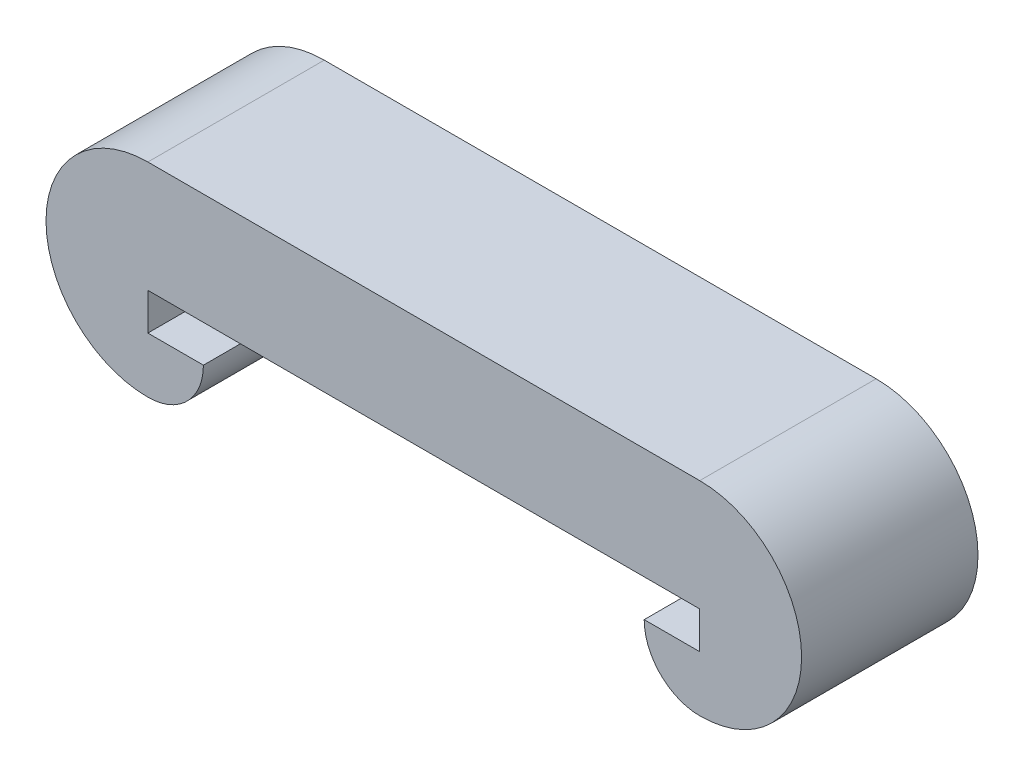
ISO-10303-21;
HEADER;
FILE_DESCRIPTION(('STEP AP214'),'2;1');
FILE_NAME('part.step','',(''),(''),'','','');
FILE_SCHEMA(('AUTOMOTIVE_DESIGN { 1 0 10303 214 1 1 1 1 }'));
ENDSEC;
DATA;
#1=APPLICATION_CONTEXT('core data for automotive mechanical design processes');
#2=APPLICATION_PROTOCOL_DEFINITION('international standard','automotive_design',2000,#1);
#3=PRODUCT_CONTEXT('',#1,'mechanical');
#4=PRODUCT('Part','Part','',(#3));
#5=PRODUCT_RELATED_PRODUCT_CATEGORY('part','',(#4));
#6=PRODUCT_DEFINITION_FORMATION('','',#4);
#7=PRODUCT_DEFINITION_CONTEXT('part definition',#1,'design');
#8=PRODUCT_DEFINITION('design','',#6,#7);
#9=PRODUCT_DEFINITION_SHAPE('','',#8);
#10=(LENGTH_UNIT() NAMED_UNIT(*) SI_UNIT(.MILLI.,.METRE.));
#11=(NAMED_UNIT(*) PLANE_ANGLE_UNIT() SI_UNIT($,.RADIAN.));
#12=(NAMED_UNIT(*) SI_UNIT($,.STERADIAN.) SOLID_ANGLE_UNIT());
#13=UNCERTAINTY_MEASURE_WITH_UNIT(LENGTH_MEASURE(1.E-05),#10,'distance_accuracy_value','');
#14=(GEOMETRIC_REPRESENTATION_CONTEXT(3) GLOBAL_UNCERTAINTY_ASSIGNED_CONTEXT((#13)) GLOBAL_UNIT_ASSIGNED_CONTEXT((#10,
#11,#12)) REPRESENTATION_CONTEXT('',''));
#15=CARTESIAN_POINT('',(0.,0.,0.));
#16=DIRECTION('',(0.,0.,1.));
#17=DIRECTION('',(1.,0.,0.));
#18=AXIS2_PLACEMENT_3D('',#15,#16,#17);
#19=CARTESIAN_POINT('',(-7.45,0.,4.7625));
#20=DIRECTION('',(-1.,0.,0.));
#21=DIRECTION('',(0.,0.,1.));
#22=AXIS2_PLACEMENT_3D('',#19,#20,#21);
#23=PLANE('',#22);
#24=DIRECTION('',(0.,1.,0.));
#25=VECTOR('',#24,1.);
#26=CARTESIAN_POINT('',(-7.45,0.,0.));
#27=LINE('',#26,#25);
#28=CARTESIAN_POINT('',(-7.45,-1.,0.));
#29=VERTEX_POINT('',#28);
#30=CARTESIAN_POINT('',(-7.45,0.,0.));
#31=VERTEX_POINT('',#30);
#32=EDGE_CURVE('E114',#29,#31,#27,.T.);
#33=ORIENTED_EDGE('',*,*,#32,.T.);
#34=DIRECTION('',(0.,0.,-1.));
#35=VECTOR('',#34,1.);
#36=CARTESIAN_POINT('',(-7.45,0.,4.7625));
#37=LINE('',#36,#35);
#38=CARTESIAN_POINT('',(-7.45,0.,4.7625));
#39=VERTEX_POINT('',#38);
#40=EDGE_CURVE('E11',#39,#31,#37,.T.);
#41=ORIENTED_EDGE('',*,*,#40,.F.);
#42=DIRECTION('',(0.,1.,0.));
#43=VECTOR('',#42,1.);
#44=CARTESIAN_POINT('',(-7.45,0.,4.7625));
#45=LINE('',#44,#43);
#46=CARTESIAN_POINT('',(-7.45,-1.,4.7625));
#47=VERTEX_POINT('',#46);
#48=EDGE_CURVE('E126',#47,#39,#45,.T.);
#49=ORIENTED_EDGE('',*,*,#48,.F.);
#50=DIRECTION('',(0.,0.,-1.));
#51=VECTOR('',#50,1.);
#52=CARTESIAN_POINT('',(-7.45,-1.,4.7625));
#53=LINE('',#52,#51);
#54=EDGE_CURVE('E110',#47,#29,#53,.T.);
#55=ORIENTED_EDGE('',*,*,#54,.T.);
#56=EDGE_LOOP('',(#33,#41,#49,#55));
#57=FACE_BOUND('',#56,.T.);
#58=ADVANCED_FACE('F31',(#57),#23,.F.);
#59=CARTESIAN_POINT('',(-7.45,0.,4.7625));
#60=DIRECTION('',(0.,1.,0.));
#61=DIRECTION('',(0.,0.,1.));
#62=AXIS2_PLACEMENT_3D('',#59,#60,#61);
#63=PLANE('',#62);
#64=DIRECTION('',(1.,0.,0.));
#65=VECTOR('',#64,1.);
#66=CARTESIAN_POINT('',(-7.45,0.,0.));
#67=LINE('',#66,#65);
#68=CARTESIAN_POINT('',(7.45,0.,0.));
#69=VERTEX_POINT('',#68);
#70=EDGE_CURVE('E117',#31,#69,#67,.T.);
#71=ORIENTED_EDGE('',*,*,#70,.T.);
#72=DIRECTION('',(0.,0.,-1.));
#73=VECTOR('',#72,1.);
#74=CARTESIAN_POINT('',(7.45,0.,4.7625));
#75=LINE('',#74,#73);
#76=CARTESIAN_POINT('',(7.45,0.,4.7625));
#77=VERTEX_POINT('',#76);
#78=EDGE_CURVE('E265',#77,#69,#75,.T.);
#79=ORIENTED_EDGE('',*,*,#78,.F.);
#80=DIRECTION('',(1.,0.,0.));
#81=VECTOR('',#80,1.);
#82=CARTESIAN_POINT('',(-7.45,0.,4.7625));
#83=LINE('',#82,#81);
#84=EDGE_CURVE('E82',#39,#77,#83,.T.);
#85=ORIENTED_EDGE('',*,*,#84,.F.);
#86=ORIENTED_EDGE('',*,*,#40,.T.);
#87=EDGE_LOOP('',(#71,#79,#85,#86));
#88=FACE_BOUND('',#87,.T.);
#89=ADVANCED_FACE('F151',(#88),#63,.F.);
#90=CARTESIAN_POINT('',(-7.45,3.,4.7625));
#91=DIRECTION('',(0.,-1.,0.));
#92=DIRECTION('',(0.,0.,-1.));
#93=AXIS2_PLACEMENT_3D('',#90,#91,#92);
#94=PLANE('',#93);
#95=DIRECTION('',(-1.,0.,0.));
#96=VECTOR('',#95,1.);
#97=CARTESIAN_POINT('',(-7.45,3.,0.));
#98=LINE('',#97,#96);
#99=CARTESIAN_POINT('',(7.45,3.00000000000001,0.));
#100=VERTEX_POINT('',#99);
#101=CARTESIAN_POINT('',(-7.45,3.,0.));
#102=VERTEX_POINT('',#101);
#103=EDGE_CURVE('E121',#100,#102,#98,.T.);
#104=ORIENTED_EDGE('',*,*,#103,.T.);
#105=DIRECTION('',(0.,0.,-1.));
#106=VECTOR('',#105,1.);
#107=CARTESIAN_POINT('',(-7.45,3.,4.7625));
#108=LINE('',#107,#106);
#109=CARTESIAN_POINT('',(-7.45,3.,4.7625));
#110=VERTEX_POINT('',#109);
#111=EDGE_CURVE('E39',#110,#102,#108,.T.);
#112=ORIENTED_EDGE('',*,*,#111,.F.);
#113=DIRECTION('',(-1.,0.,0.));
#114=VECTOR('',#113,1.);
#115=CARTESIAN_POINT('',(-7.45,3.,4.7625));
#116=LINE('',#115,#114);
#117=CARTESIAN_POINT('',(7.45,3.00000000000001,4.7625));
#118=VERTEX_POINT('',#117);
#119=EDGE_CURVE('E97',#118,#110,#116,.T.);
#120=ORIENTED_EDGE('',*,*,#119,.F.);
#121=DIRECTION('',(0.,0.,-1.));
#122=VECTOR('',#121,1.);
#123=CARTESIAN_POINT('',(7.45,3.00000000000001,4.7625));
#124=LINE('',#123,#122);
#125=EDGE_CURVE('E249',#118,#100,#124,.T.);
#126=ORIENTED_EDGE('',*,*,#125,.T.);
#127=EDGE_LOOP('',(#104,#112,#120,#126));
#128=FACE_BOUND('',#127,.T.);
#129=ADVANCED_FACE('F155',(#128),#94,.F.);
#130=CARTESIAN_POINT('',(-7.45,0.25,4.7625));
#131=DIRECTION('',(0.,0.,-1.));
#132=DIRECTION('',(-1.,0.,0.));
#133=AXIS2_PLACEMENT_3D('',#130,#131,#132);
#134=CYLINDRICAL_SURFACE('',#133,2.75);
#135=CARTESIAN_POINT('',(-7.45,0.25,0.));
#136=DIRECTION('',(0.,0.,1.));
#137=DIRECTION('',(-1.,0.,0.));
#138=AXIS2_PLACEMENT_3D('',#135,#136,#137);
#139=CIRCLE('',#138,2.75);
#140=CARTESIAN_POINT('',(-7.45,-2.5,0.));
#141=VERTEX_POINT('',#140);
#142=EDGE_CURVE('E105',#102,#141,#139,.T.);
#143=ORIENTED_EDGE('',*,*,#142,.T.);
#144=DIRECTION('',(0.,0.,-1.));
#145=VECTOR('',#144,1.);
#146=CARTESIAN_POINT('',(-7.45,-2.5,4.7625));
#147=LINE('',#146,#145);
#148=CARTESIAN_POINT('',(-7.45,-2.5,4.7625));
#149=VERTEX_POINT('',#148);
#150=EDGE_CURVE('E102',#149,#141,#147,.T.);
#151=ORIENTED_EDGE('',*,*,#150,.F.);
#152=CARTESIAN_POINT('',(-7.45,0.25,4.7625));
#153=DIRECTION('',(0.,0.,1.));
#154=DIRECTION('',(-1.,0.,0.));
#155=AXIS2_PLACEMENT_3D('',#152,#153,#154);
#156=CIRCLE('',#155,2.75);
#157=EDGE_CURVE('E90',#110,#149,#156,.T.);
#158=ORIENTED_EDGE('',*,*,#157,.F.);
#159=ORIENTED_EDGE('',*,*,#111,.T.);
#160=EDGE_LOOP('',(#143,#151,#158,#159));
#161=FACE_BOUND('',#160,.T.);
#162=ADVANCED_FACE('F103',(#161),#134,.T.);
#163=CARTESIAN_POINT('',(-7.45,-1.,4.7625));
#164=DIRECTION('',(0.,0.,-1.));
#165=DIRECTION('',(-1.,0.,0.));
#166=AXIS2_PLACEMENT_3D('',#163,#164,#165);
#167=CYLINDRICAL_SURFACE('',#166,1.5);
#168=CARTESIAN_POINT('',(-7.45,-1.,0.));
#169=DIRECTION('',(0.,0.,1.));
#170=DIRECTION('',(-1.,0.,0.));
#171=AXIS2_PLACEMENT_3D('',#168,#169,#170);
#172=CIRCLE('',#171,1.5);
#173=CARTESIAN_POINT('',(-5.95,-1.,0.));
#174=VERTEX_POINT('',#173);
#175=EDGE_CURVE('E68',#141,#174,#172,.T.);
#176=ORIENTED_EDGE('',*,*,#175,.T.);
#177=DIRECTION('',(0.,0.,-1.));
#178=VECTOR('',#177,1.);
#179=CARTESIAN_POINT('',(-5.95,-1.,4.7625));
#180=LINE('',#179,#178);
#181=CARTESIAN_POINT('',(-5.95,-1.,4.7625));
#182=VERTEX_POINT('',#181);
#183=EDGE_CURVE('E106',#182,#174,#180,.T.);
#184=ORIENTED_EDGE('',*,*,#183,.F.);
#185=CARTESIAN_POINT('',(-7.45,-1.,4.7625));
#186=DIRECTION('',(0.,0.,1.));
#187=DIRECTION('',(-1.,0.,0.));
#188=AXIS2_PLACEMENT_3D('',#185,#186,#187);
#189=CIRCLE('',#188,1.5);
#190=EDGE_CURVE('E94',#149,#182,#189,.T.);
#191=ORIENTED_EDGE('',*,*,#190,.F.);
#192=ORIENTED_EDGE('',*,*,#150,.T.);
#193=EDGE_LOOP('',(#176,#184,#191,#192));
#194=FACE_BOUND('',#193,.T.);
#195=ADVANCED_FACE('F108',(#194),#167,.T.);
#196=CARTESIAN_POINT('',(-7.45,-1.,4.7625));
#197=DIRECTION('',(0.,-1.,0.));
#198=DIRECTION('',(0.,0.,-1.));
#199=AXIS2_PLACEMENT_3D('',#196,#197,#198);
#200=PLANE('',#199);
#201=DIRECTION('',(-1.,0.,0.));
#202=VECTOR('',#201,1.);
#203=CARTESIAN_POINT('',(-7.45,-1.,0.));
#204=LINE('',#203,#202);
#205=EDGE_CURVE('E74',#174,#29,#204,.T.);
#206=ORIENTED_EDGE('',*,*,#205,.T.);
#207=ORIENTED_EDGE('',*,*,#54,.F.);
#208=DIRECTION('',(-1.,0.,0.));
#209=VECTOR('',#208,1.);
#210=CARTESIAN_POINT('',(-7.45,-1.,4.7625));
#211=LINE('',#210,#209);
#212=EDGE_CURVE('E47',#182,#47,#211,.T.);
#213=ORIENTED_EDGE('',*,*,#212,.F.);
#214=ORIENTED_EDGE('',*,*,#183,.T.);
#215=EDGE_LOOP('',(#206,#207,#213,#214));
#216=FACE_BOUND('',#215,.T.);
#217=ADVANCED_FACE('F140',(#216),#200,.F.);
#218=CARTESIAN_POINT('',(-7.45,-1.,4.7625));
#219=DIRECTION('',(0.,0.,-1.));
#220=DIRECTION('',(-1.,0.,0.));
#221=AXIS2_PLACEMENT_3D('',#218,#219,#220);
#222=PLANE('',#221);
#223=ORIENTED_EDGE('',*,*,#48,.T.);
#224=ORIENTED_EDGE('',*,*,#84,.T.);
#225=DIRECTION('',(0.,1.,0.));
#226=VECTOR('',#225,1.);
#227=CARTESIAN_POINT('',(7.45,0.,4.7625));
#228=LINE('',#227,#226);
#229=CARTESIAN_POINT('',(7.45,-0.999999999999996,4.7625));
#230=VERTEX_POINT('',#229);
#231=EDGE_CURVE('E255',#230,#77,#228,.T.);
#232=ORIENTED_EDGE('',*,*,#231,.F.);
#233=DIRECTION('',(1.,0.,0.));
#234=VECTOR('',#233,1.);
#235=CARTESIAN_POINT('',(7.45,-0.999999999999996,4.7625));
#236=LINE('',#235,#234);
#237=CARTESIAN_POINT('',(5.95,-0.999999999999996,4.7625));
#238=VERTEX_POINT('',#237);
#239=EDGE_CURVE('E259',#238,#230,#236,.T.);
#240=ORIENTED_EDGE('',*,*,#239,.F.);
#241=CARTESIAN_POINT('',(7.45,-0.999999999999996,4.7625));
#242=DIRECTION('',(0.,0.,-1.));
#243=DIRECTION('',(1.,0.,0.));
#244=AXIS2_PLACEMENT_3D('',#241,#242,#243);
#245=CIRCLE('',#244,1.5);
#246=CARTESIAN_POINT('',(7.45,-2.5,4.7625));
#247=VERTEX_POINT('',#246);
#248=EDGE_CURVE('E301',#247,#238,#245,.T.);
#249=ORIENTED_EDGE('',*,*,#248,.F.);
#250=CARTESIAN_POINT('',(7.45,0.250000000000004,4.7625));
#251=DIRECTION('',(0.,0.,-1.));
#252=DIRECTION('',(1.,0.,0.));
#253=AXIS2_PLACEMENT_3D('',#250,#251,#252);
#254=CIRCLE('',#253,2.75);
#255=EDGE_CURVE('E268',#118,#247,#254,.T.);
#256=ORIENTED_EDGE('',*,*,#255,.F.);
#257=ORIENTED_EDGE('',*,*,#119,.T.);
#258=ORIENTED_EDGE('',*,*,#157,.T.);
#259=ORIENTED_EDGE('',*,*,#190,.T.);
#260=ORIENTED_EDGE('',*,*,#212,.T.);
#261=EDGE_LOOP('',(#223,#224,#232,#240,#249,#256,#257,#258,#259,#260));
#262=FACE_BOUND('',#261,.T.);
#263=ADVANCED_FACE('F92',(#262),#222,.F.);
#264=CARTESIAN_POINT('',(-7.45,-1.,0.));
#265=DIRECTION('',(0.,0.,-1.));
#266=DIRECTION('',(-1.,0.,0.));
#267=AXIS2_PLACEMENT_3D('',#264,#265,#266);
#268=PLANE('',#267);
#269=ORIENTED_EDGE('',*,*,#32,.F.);
#270=ORIENTED_EDGE('',*,*,#205,.F.);
#271=ORIENTED_EDGE('',*,*,#175,.F.);
#272=ORIENTED_EDGE('',*,*,#142,.F.);
#273=ORIENTED_EDGE('',*,*,#103,.F.);
#274=CARTESIAN_POINT('',(7.45,0.250000000000004,0.));
#275=DIRECTION('',(0.,0.,-1.));
#276=DIRECTION('',(1.,0.,0.));
#277=AXIS2_PLACEMENT_3D('',#274,#275,#276);
#278=CIRCLE('',#277,2.75);
#279=CARTESIAN_POINT('',(7.45,-2.5,0.));
#280=VERTEX_POINT('',#279);
#281=EDGE_CURVE('E246',#100,#280,#278,.T.);
#282=ORIENTED_EDGE('',*,*,#281,.T.);
#283=CARTESIAN_POINT('',(7.45,-0.999999999999996,0.));
#284=DIRECTION('',(0.,0.,-1.));
#285=DIRECTION('',(1.,0.,0.));
#286=AXIS2_PLACEMENT_3D('',#283,#284,#285);
#287=CIRCLE('',#286,1.5);
#288=CARTESIAN_POINT('',(5.95,-0.999999999999996,0.));
#289=VERTEX_POINT('',#288);
#290=EDGE_CURVE('E256',#280,#289,#287,.T.);
#291=ORIENTED_EDGE('',*,*,#290,.T.);
#292=DIRECTION('',(1.,0.,0.));
#293=VECTOR('',#292,1.);
#294=CARTESIAN_POINT('',(7.45,-0.999999999999996,0.));
#295=LINE('',#294,#293);
#296=CARTESIAN_POINT('',(7.45,-0.999999999999996,0.));
#297=VERTEX_POINT('',#296);
#298=EDGE_CURVE('E261',#289,#297,#295,.T.);
#299=ORIENTED_EDGE('',*,*,#298,.T.);
#300=DIRECTION('',(0.,1.,0.));
#301=VECTOR('',#300,1.);
#302=CARTESIAN_POINT('',(7.45,0.,0.));
#303=LINE('',#302,#301);
#304=EDGE_CURVE('E285',#297,#69,#303,.T.);
#305=ORIENTED_EDGE('',*,*,#304,.T.);
#306=ORIENTED_EDGE('',*,*,#70,.F.);
#307=EDGE_LOOP('',(#269,#270,#271,#272,#273,#282,#291,#299,#305,#306));
#308=FACE_BOUND('',#307,.T.);
#309=ADVANCED_FACE('F132',(#308),#268,.T.);
#310=CARTESIAN_POINT('',(7.45,0.,4.7625));
#311=DIRECTION('',(-1.,0.,0.));
#312=DIRECTION('',(0.,-1.,0.));
#313=AXIS2_PLACEMENT_3D('',#310,#311,#312);
#314=PLANE('',#313);
#315=ORIENTED_EDGE('',*,*,#304,.F.);
#316=DIRECTION('',(0.,0.,-1.));
#317=VECTOR('',#316,1.);
#318=CARTESIAN_POINT('',(7.45,-0.999999999999996,4.7625));
#319=LINE('',#318,#317);
#320=EDGE_CURVE('E118',#230,#297,#319,.T.);
#321=ORIENTED_EDGE('',*,*,#320,.F.);
#322=ORIENTED_EDGE('',*,*,#231,.T.);
#323=ORIENTED_EDGE('',*,*,#78,.T.);
#324=EDGE_LOOP('',(#315,#321,#322,#323));
#325=FACE_BOUND('',#324,.T.);
#326=ADVANCED_FACE('F201',(#325),#314,.T.);
#327=CARTESIAN_POINT('',(7.45,-0.999999999999996,4.7625));
#328=DIRECTION('',(0.,1.,0.));
#329=DIRECTION('',(-1.,0.,0.));
#330=AXIS2_PLACEMENT_3D('',#327,#328,#329);
#331=PLANE('',#330);
#332=ORIENTED_EDGE('',*,*,#298,.F.);
#333=DIRECTION('',(0.,0.,-1.));
#334=VECTOR('',#333,1.);
#335=CARTESIAN_POINT('',(5.95,-0.999999999999996,4.7625));
#336=LINE('',#335,#334);
#337=EDGE_CURVE('E271',#238,#289,#336,.T.);
#338=ORIENTED_EDGE('',*,*,#337,.F.);
#339=ORIENTED_EDGE('',*,*,#239,.T.);
#340=ORIENTED_EDGE('',*,*,#320,.T.);
#341=EDGE_LOOP('',(#332,#338,#339,#340));
#342=FACE_BOUND('',#341,.T.);
#343=ADVANCED_FACE('F209',(#342),#331,.T.);
#344=CARTESIAN_POINT('',(7.45,-0.999999999999996,4.7625));
#345=DIRECTION('',(0.,0.,-1.));
#346=DIRECTION('',(-1.,0.,0.));
#347=AXIS2_PLACEMENT_3D('',#344,#345,#346);
#348=CYLINDRICAL_SURFACE('',#347,1.5);
#349=ORIENTED_EDGE('',*,*,#290,.F.);
#350=DIRECTION('',(0.,0.,-1.));
#351=VECTOR('',#350,1.);
#352=CARTESIAN_POINT('',(7.45,-2.5,4.7625));
#353=LINE('',#352,#351);
#354=EDGE_CURVE('E252',#247,#280,#353,.T.);
#355=ORIENTED_EDGE('',*,*,#354,.F.);
#356=ORIENTED_EDGE('',*,*,#248,.T.);
#357=ORIENTED_EDGE('',*,*,#337,.T.);
#358=EDGE_LOOP('',(#349,#355,#356,#357));
#359=FACE_BOUND('',#358,.T.);
#360=ADVANCED_FACE('F219',(#359),#348,.T.);
#361=CARTESIAN_POINT('',(7.45,0.250000000000004,4.7625));
#362=DIRECTION('',(0.,0.,-1.));
#363=DIRECTION('',(-1.,0.,0.));
#364=AXIS2_PLACEMENT_3D('',#361,#362,#363);
#365=CYLINDRICAL_SURFACE('',#364,2.75);
#366=ORIENTED_EDGE('',*,*,#281,.F.);
#367=ORIENTED_EDGE('',*,*,#125,.F.);
#368=ORIENTED_EDGE('',*,*,#255,.T.);
#369=ORIENTED_EDGE('',*,*,#354,.T.);
#370=EDGE_LOOP('',(#366,#367,#368,#369));
#371=FACE_BOUND('',#370,.T.);
#372=ADVANCED_FACE('F229',(#371),#365,.T.);
#373=CLOSED_SHELL('',(#58,#89,#129,#162,#195,#217,#263,#309,#326,#343,#360,#372));
#374=MANIFOLD_SOLID_BREP('B2',#373);
#375=ADVANCED_BREP_SHAPE_REPRESENTATION('',(#18,#374),#14);
#376=SHAPE_DEFINITION_REPRESENTATION(#9,#375);
ENDSEC;
END-ISO-10303-21;
